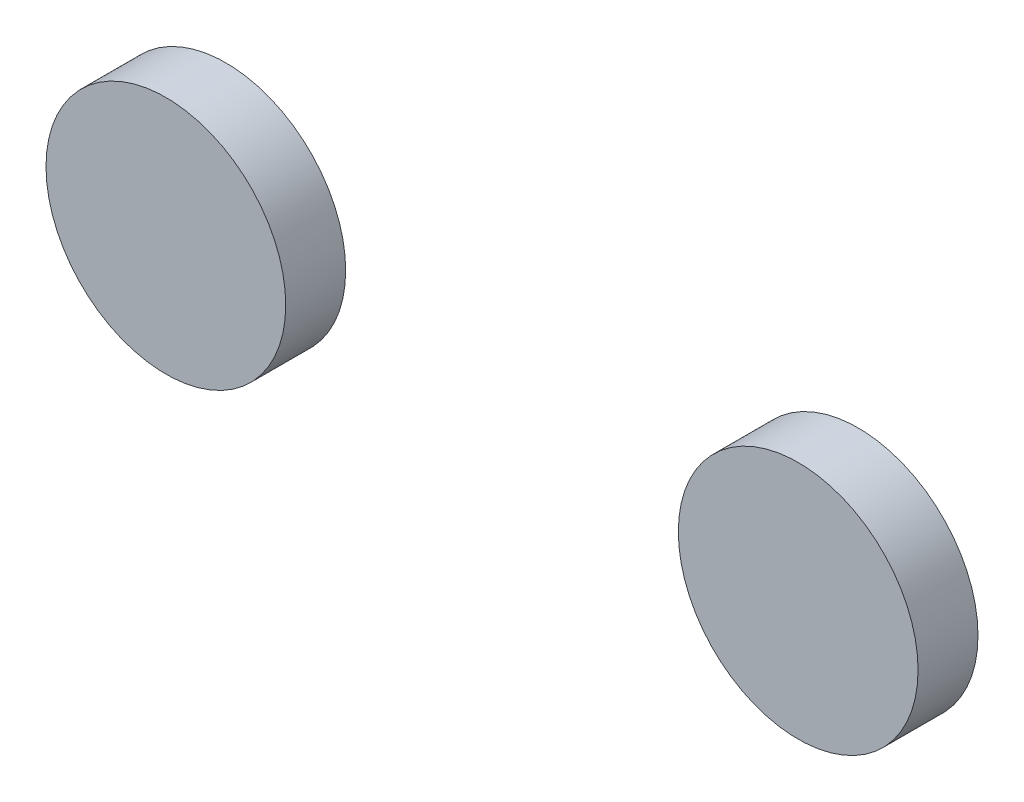
ISO-10303-21;
HEADER;
FILE_DESCRIPTION(('STEP AP214'),'2;1');
FILE_NAME('part.step','',(''),(''),'','','');
FILE_SCHEMA(('AUTOMOTIVE_DESIGN { 1 0 10303 214 1 1 1 1 }'));
ENDSEC;
DATA;
#1=APPLICATION_CONTEXT('core data for automotive mechanical design processes');
#2=APPLICATION_PROTOCOL_DEFINITION('international standard','automotive_design',2000,#1);
#3=PRODUCT_CONTEXT('',#1,'mechanical');
#4=PRODUCT('Part','Part','',(#3));
#5=PRODUCT_RELATED_PRODUCT_CATEGORY('part','',(#4));
#6=PRODUCT_DEFINITION_FORMATION('','',#4);
#7=PRODUCT_DEFINITION_CONTEXT('part definition',#1,'design');
#8=PRODUCT_DEFINITION('design','',#6,#7);
#9=PRODUCT_DEFINITION_SHAPE('','',#8);
#10=(LENGTH_UNIT() NAMED_UNIT(*) SI_UNIT(.MILLI.,.METRE.));
#11=(NAMED_UNIT(*) PLANE_ANGLE_UNIT() SI_UNIT($,.RADIAN.));
#12=(NAMED_UNIT(*) SI_UNIT($,.STERADIAN.) SOLID_ANGLE_UNIT());
#13=UNCERTAINTY_MEASURE_WITH_UNIT(LENGTH_MEASURE(1.E-05),#10,'distance_accuracy_value','');
#14=(GEOMETRIC_REPRESENTATION_CONTEXT(3) GLOBAL_UNCERTAINTY_ASSIGNED_CONTEXT((#13)) GLOBAL_UNIT_ASSIGNED_CONTEXT((#10,
#11,#12)) REPRESENTATION_CONTEXT('',''));
#15=CARTESIAN_POINT('',(0.,0.,0.));
#16=DIRECTION('',(0.,0.,1.));
#17=DIRECTION('',(1.,0.,0.));
#18=AXIS2_PLACEMENT_3D('',#15,#16,#17);
#19=CARTESIAN_POINT('',(54.1309889488754,-5.03090536683552,10.));
#20=DIRECTION('',(0.,0.,-1.));
#21=DIRECTION('',(-1.,0.,0.));
#22=AXIS2_PLACEMENT_3D('',#19,#20,#21);
#23=CYLINDRICAL_SURFACE('',#22,20.);
#24=CARTESIAN_POINT('',(54.1309889488754,-5.03090536683552,10.));
#25=DIRECTION('',(0.,0.,1.));
#26=DIRECTION('',(1.,0.,0.));
#27=AXIS2_PLACEMENT_3D('',#24,#25,#26);
#28=CIRCLE('',#27,20.);
#29=CARTESIAN_POINT('',(74.1309889488754,-5.03090536683552,10.));
#30=VERTEX_POINT('',#29);
#31=EDGE_CURVE('E11',#30,#30,#28,.T.);
#32=ORIENTED_EDGE('',*,*,#31,.F.);
#33=EDGE_LOOP('',(#32));
#34=FACE_BOUND('',#33,.T.);
#35=CARTESIAN_POINT('',(54.1309889488754,-5.03090536683552,0.));
#36=DIRECTION('',(0.,0.,1.));
#37=DIRECTION('',(1.,0.,0.));
#38=AXIS2_PLACEMENT_3D('',#35,#36,#37);
#39=CIRCLE('',#38,20.);
#40=CARTESIAN_POINT('',(74.1309889488754,-5.03090536683552,0.));
#41=VERTEX_POINT('',#40);
#42=EDGE_CURVE('E50',#41,#41,#39,.T.);
#43=ORIENTED_EDGE('',*,*,#42,.T.);
#44=EDGE_LOOP('',(#43));
#45=FACE_BOUND('',#44,.T.);
#46=ADVANCED_FACE('F47',(#34,#45),#23,.T.);
#47=CARTESIAN_POINT('',(0.,0.,10.));
#48=DIRECTION('',(0.,0.,1.));
#49=DIRECTION('',(1.,0.,0.));
#50=AXIS2_PLACEMENT_3D('',#47,#48,#49);
#51=PLANE('',#50);
#52=ORIENTED_EDGE('',*,*,#31,.T.);
#53=EDGE_LOOP('',(#52));
#54=FACE_BOUND('',#53,.T.);
#55=ADVANCED_FACE('F64',(#54),#51,.T.);
#56=CARTESIAN_POINT('',(0.,0.,0.));
#57=DIRECTION('',(0.,0.,1.));
#58=DIRECTION('',(1.,0.,0.));
#59=AXIS2_PLACEMENT_3D('',#56,#57,#58);
#60=PLANE('',#59);
#61=ORIENTED_EDGE('',*,*,#42,.F.);
#62=EDGE_LOOP('',(#61));
#63=FACE_BOUND('',#62,.T.);
#64=ADVANCED_FACE('F62',(#63),#60,.F.);
#65=CLOSED_SHELL('',(#46,#55,#64));
#66=MANIFOLD_SOLID_BREP('B2',#65);
#67=CARTESIAN_POINT('',(-51.3690110511246,-5.03090536683552,10.));
#68=DIRECTION('',(0.,0.,-1.));
#69=DIRECTION('',(-1.,0.,0.));
#70=AXIS2_PLACEMENT_3D('',#67,#68,#69);
#71=CYLINDRICAL_SURFACE('',#70,20.);
#72=CARTESIAN_POINT('',(-51.3690110511246,-5.03090536683552,10.));
#73=DIRECTION('',(0.,0.,1.));
#74=DIRECTION('',(1.,0.,0.));
#75=AXIS2_PLACEMENT_3D('',#72,#73,#74);
#76=CIRCLE('',#75,20.);
#77=CARTESIAN_POINT('',(-31.3690110511246,-5.03090536683552,10.));
#78=VERTEX_POINT('',#77);
#79=EDGE_CURVE('E46',#78,#78,#76,.T.);
#80=ORIENTED_EDGE('',*,*,#79,.F.);
#81=EDGE_LOOP('',(#80));
#82=FACE_BOUND('',#81,.T.);
#83=CARTESIAN_POINT('',(-51.3690110511246,-5.03090536683552,0.));
#84=DIRECTION('',(0.,0.,1.));
#85=DIRECTION('',(1.,0.,0.));
#86=AXIS2_PLACEMENT_3D('',#83,#84,#85);
#87=CIRCLE('',#86,20.);
#88=CARTESIAN_POINT('',(-31.3690110511246,-5.03090536683552,0.));
#89=VERTEX_POINT('',#88);
#90=EDGE_CURVE('E99',#89,#89,#87,.T.);
#91=ORIENTED_EDGE('',*,*,#90,.T.);
#92=EDGE_LOOP('',(#91));
#93=FACE_BOUND('',#92,.T.);
#94=ADVANCED_FACE('F96',(#82,#93),#71,.T.);
#95=CARTESIAN_POINT('',(0.,0.,10.));
#96=DIRECTION('',(0.,0.,1.));
#97=DIRECTION('',(1.,0.,0.));
#98=AXIS2_PLACEMENT_3D('',#95,#96,#97);
#99=PLANE('',#98);
#100=ORIENTED_EDGE('',*,*,#79,.T.);
#101=EDGE_LOOP('',(#100));
#102=FACE_BOUND('',#101,.T.);
#103=ADVANCED_FACE('F111',(#102),#99,.T.);
#104=CARTESIAN_POINT('',(0.,0.,0.));
#105=DIRECTION('',(0.,0.,1.));
#106=DIRECTION('',(1.,0.,0.));
#107=AXIS2_PLACEMENT_3D('',#104,#105,#106);
#108=PLANE('',#107);
#109=ORIENTED_EDGE('',*,*,#90,.F.);
#110=EDGE_LOOP('',(#109));
#111=FACE_BOUND('',#110,.T.);
#112=ADVANCED_FACE('F109',(#111),#108,.F.);
#113=CLOSED_SHELL('',(#94,#103,#112));
#114=MANIFOLD_SOLID_BREP('B6',#113);
#115=ADVANCED_BREP_SHAPE_REPRESENTATION('',(#18,#66,#114),#14);
#116=SHAPE_DEFINITION_REPRESENTATION(#9,#115);
ENDSEC;
END-ISO-10303-21;
